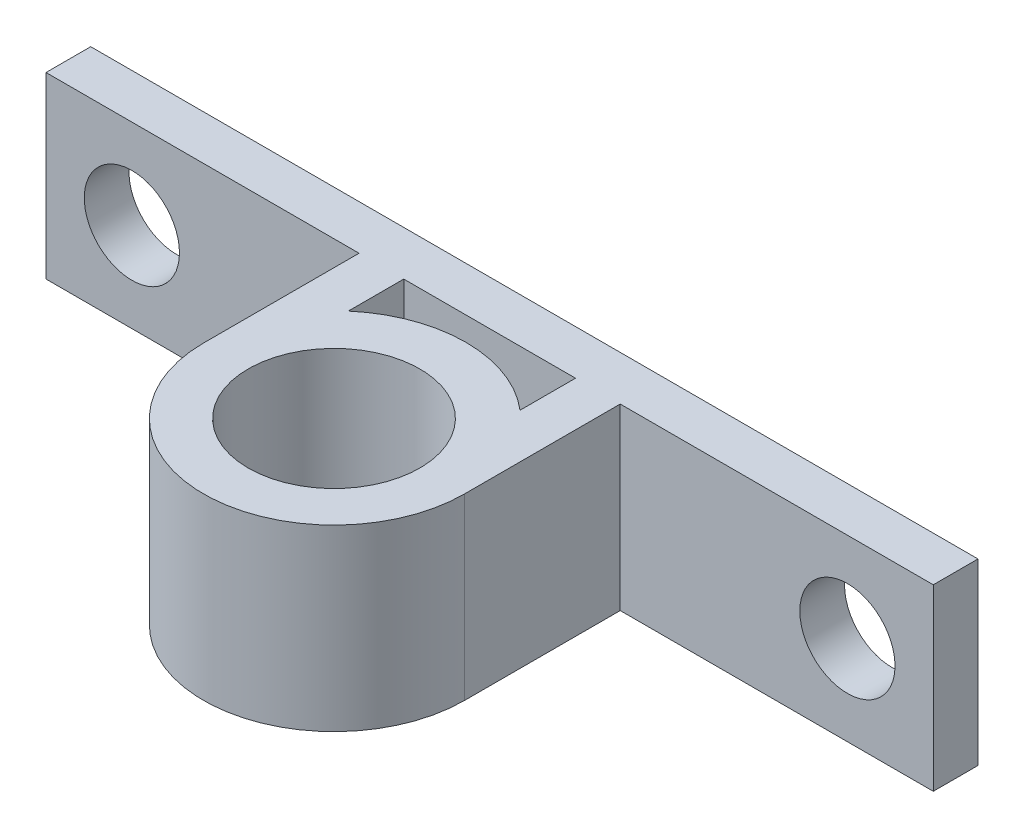
ISO-10303-21;
HEADER;
FILE_DESCRIPTION(('STEP AP214'),'2;1');
FILE_NAME('part.step','',(''),(''),'','','');
FILE_SCHEMA(('AUTOMOTIVE_DESIGN { 1 0 10303 214 1 1 1 1 }'));
ENDSEC;
DATA;
#1=APPLICATION_CONTEXT('core data for automotive mechanical design processes');
#2=APPLICATION_PROTOCOL_DEFINITION('international standard','automotive_design',2000,#1);
#3=PRODUCT_CONTEXT('',#1,'mechanical');
#4=PRODUCT('Part','Part','',(#3));
#5=PRODUCT_RELATED_PRODUCT_CATEGORY('part','',(#4));
#6=PRODUCT_DEFINITION_FORMATION('','',#4);
#7=PRODUCT_DEFINITION_CONTEXT('part definition',#1,'design');
#8=PRODUCT_DEFINITION('design','',#6,#7);
#9=PRODUCT_DEFINITION_SHAPE('','',#8);
#10=(LENGTH_UNIT() NAMED_UNIT(*) SI_UNIT(.MILLI.,.METRE.));
#11=(NAMED_UNIT(*) PLANE_ANGLE_UNIT() SI_UNIT($,.RADIAN.));
#12=(NAMED_UNIT(*) SI_UNIT($,.STERADIAN.) SOLID_ANGLE_UNIT());
#13=UNCERTAINTY_MEASURE_WITH_UNIT(LENGTH_MEASURE(1.E-05),#10,'distance_accuracy_value','');
#14=(GEOMETRIC_REPRESENTATION_CONTEXT(3) GLOBAL_UNCERTAINTY_ASSIGNED_CONTEXT((#13)) GLOBAL_UNIT_ASSIGNED_CONTEXT((#10,
#11,#12)) REPRESENTATION_CONTEXT('',''));
#15=CARTESIAN_POINT('',(0.,0.,0.));
#16=DIRECTION('',(0.,0.,1.));
#17=DIRECTION('',(1.,0.,0.));
#18=AXIS2_PLACEMENT_3D('',#15,#16,#17);
#19=CARTESIAN_POINT('',(0.,12.7,0.));
#20=DIRECTION('',(0.,-1.,0.));
#21=DIRECTION('',(0.,0.,-1.));
#22=AXIS2_PLACEMENT_3D('',#19,#20,#21);
#23=PLANE('',#22);
#24=CARTESIAN_POINT('',(0.,12.7,0.));
#25=DIRECTION('',(0.,1.,0.));
#26=DIRECTION('',(0.,0.,1.));
#27=AXIS2_PLACEMENT_3D('',#24,#25,#26);
#28=CIRCLE('',#27,6.096);
#29=CARTESIAN_POINT('',(0.,12.7,6.096));
#30=VERTEX_POINT('',#29);
#31=EDGE_CURVE('E159',#30,#30,#28,.T.);
#32=ORIENTED_EDGE('',*,*,#31,.F.);
#33=EDGE_LOOP('',(#32));
#34=FACE_BOUND('',#33,.T.);
#35=CARTESIAN_POINT('',(0.,12.7,0.));
#36=DIRECTION('',(0.,1.,0.));
#37=DIRECTION('',(0.,0.,-1.));
#38=AXIS2_PLACEMENT_3D('',#35,#36,#37);
#39=CIRCLE('',#38,9.271);
#40=CARTESIAN_POINT('',(-9.271,12.7,0.));
#41=VERTEX_POINT('',#40);
#42=CARTESIAN_POINT('',(9.271,12.7,0.));
#43=VERTEX_POINT('',#42);
#44=EDGE_CURVE('E165',#41,#43,#39,.T.);
#45=ORIENTED_EDGE('',*,*,#44,.T.);
#46=DIRECTION('',(0.,0.,-1.));
#47=VECTOR('',#46,1.);
#48=CARTESIAN_POINT('',(9.271,12.7,0.));
#49=LINE('',#48,#47);
#50=CARTESIAN_POINT('',(9.271,12.7,-11.049));
#51=VERTEX_POINT('',#50);
#52=EDGE_CURVE('E168',#43,#51,#49,.T.);
#53=ORIENTED_EDGE('',*,*,#52,.T.);
#54=DIRECTION('',(1.,0.,0.));
#55=VECTOR('',#54,1.);
#56=CARTESIAN_POINT('',(9.271,12.7,-11.049));
#57=LINE('',#56,#55);
#58=CARTESIAN_POINT('',(31.496,12.7,-11.049));
#59=VERTEX_POINT('',#58);
#60=EDGE_CURVE('E171',#51,#59,#57,.T.);
#61=ORIENTED_EDGE('',*,*,#60,.T.);
#62=DIRECTION('',(0.,0.,-1.));
#63=VECTOR('',#62,1.);
#64=CARTESIAN_POINT('',(31.496,12.7,-11.049));
#65=LINE('',#64,#63);
#66=CARTESIAN_POINT('',(31.496,12.7,-14.224));
#67=VERTEX_POINT('',#66);
#68=EDGE_CURVE('E173',#59,#67,#65,.T.);
#69=ORIENTED_EDGE('',*,*,#68,.T.);
#70=DIRECTION('',(-1.,0.,0.));
#71=VECTOR('',#70,1.);
#72=CARTESIAN_POINT('',(6.096,12.7,-14.224));
#73=LINE('',#72,#71);
#74=CARTESIAN_POINT('',(-31.496,12.7,-14.224));
#75=VERTEX_POINT('',#74);
#76=EDGE_CURVE('E175',#67,#75,#73,.T.);
#77=ORIENTED_EDGE('',*,*,#76,.T.);
#78=DIRECTION('',(0.,0.,1.));
#79=VECTOR('',#78,1.);
#80=CARTESIAN_POINT('',(-31.496,12.7,-11.049));
#81=LINE('',#80,#79);
#82=CARTESIAN_POINT('',(-31.496,12.7,-11.049));
#83=VERTEX_POINT('',#82);
#84=EDGE_CURVE('E177',#75,#83,#81,.T.);
#85=ORIENTED_EDGE('',*,*,#84,.T.);
#86=DIRECTION('',(1.,0.,0.));
#87=VECTOR('',#86,1.);
#88=CARTESIAN_POINT('',(-9.271,12.7,-11.049));
#89=LINE('',#88,#87);
#90=CARTESIAN_POINT('',(-9.271,12.7,-11.049));
#91=VERTEX_POINT('',#90);
#92=EDGE_CURVE('E179',#83,#91,#89,.T.);
#93=ORIENTED_EDGE('',*,*,#92,.T.);
#94=DIRECTION('',(0.,0.,1.));
#95=VECTOR('',#94,1.);
#96=CARTESIAN_POINT('',(-9.271,12.7,0.));
#97=LINE('',#96,#95);
#98=EDGE_CURVE('E181',#91,#41,#97,.T.);
#99=ORIENTED_EDGE('',*,*,#98,.T.);
#100=EDGE_LOOP('',(#45,#53,#61,#69,#77,#85,#93,#99));
#101=FACE_BOUND('',#100,.T.);
#102=CARTESIAN_POINT('',(0.,12.7,0.));
#103=DIRECTION('',(0.,-1.,0.));
#104=DIRECTION('',(0.,0.,-1.));
#105=AXIS2_PLACEMENT_3D('',#102,#103,#104);
#106=CIRCLE('',#105,9.36705716860957);
#107=CARTESIAN_POINT('',(-6.096,12.7,-7.112));
#108=VERTEX_POINT('',#107);
#109=CARTESIAN_POINT('',(6.096,12.7,-7.112));
#110=VERTEX_POINT('',#109);
#111=EDGE_CURVE('E121',#108,#110,#106,.T.);
#112=ORIENTED_EDGE('',*,*,#111,.F.);
#113=DIRECTION('',(0.,0.,1.));
#114=VECTOR('',#113,1.);
#115=CARTESIAN_POINT('',(-6.096,12.7,-7.112));
#116=LINE('',#115,#114);
#117=CARTESIAN_POINT('',(-6.096,12.7,-11.049));
#118=VERTEX_POINT('',#117);
#119=EDGE_CURVE('E143',#118,#108,#116,.T.);
#120=ORIENTED_EDGE('',*,*,#119,.F.);
#121=DIRECTION('',(-1.,0.,0.));
#122=VECTOR('',#121,1.);
#123=CARTESIAN_POINT('',(-6.096,12.7,-11.049));
#124=LINE('',#123,#122);
#125=CARTESIAN_POINT('',(6.096,12.7,-11.049));
#126=VERTEX_POINT('',#125);
#127=EDGE_CURVE('E141',#126,#118,#124,.T.);
#128=ORIENTED_EDGE('',*,*,#127,.F.);
#129=DIRECTION('',(0.,0.,-1.));
#130=VECTOR('',#129,1.);
#131=CARTESIAN_POINT('',(6.096,12.7,-7.112));
#132=LINE('',#131,#130);
#133=EDGE_CURVE('E129',#110,#126,#132,.T.);
#134=ORIENTED_EDGE('',*,*,#133,.F.);
#135=EDGE_LOOP('',(#112,#120,#128,#134));
#136=FACE_BOUND('',#135,.T.);
#137=ADVANCED_FACE('F32',(#34,#101,#136),#23,.F.);
#138=CARTESIAN_POINT('',(0.,0.,0.));
#139=DIRECTION('',(0.,-1.,0.));
#140=DIRECTION('',(0.,0.,-1.));
#141=AXIS2_PLACEMENT_3D('',#138,#139,#140);
#142=PLANE('',#141);
#143=CARTESIAN_POINT('',(0.,0.,0.));
#144=DIRECTION('',(0.,1.,0.));
#145=DIRECTION('',(0.,0.,-1.));
#146=AXIS2_PLACEMENT_3D('',#143,#144,#145);
#147=CIRCLE('',#146,9.271);
#148=CARTESIAN_POINT('',(-9.271,0.,0.));
#149=VERTEX_POINT('',#148);
#150=CARTESIAN_POINT('',(9.271,0.,0.));
#151=VERTEX_POINT('',#150);
#152=EDGE_CURVE('E162',#149,#151,#147,.T.);
#153=ORIENTED_EDGE('',*,*,#152,.F.);
#154=DIRECTION('',(0.,0.,1.));
#155=VECTOR('',#154,1.);
#156=CARTESIAN_POINT('',(-9.271,0.,0.));
#157=LINE('',#156,#155);
#158=CARTESIAN_POINT('',(-9.271,0.,-11.049));
#159=VERTEX_POINT('',#158);
#160=EDGE_CURVE('E169',#159,#149,#157,.T.);
#161=ORIENTED_EDGE('',*,*,#160,.F.);
#162=DIRECTION('',(1.,0.,0.));
#163=VECTOR('',#162,1.);
#164=CARTESIAN_POINT('',(-9.271,0.,-11.049));
#165=LINE('',#164,#163);
#166=CARTESIAN_POINT('',(-31.496,0.,-11.049));
#167=VERTEX_POINT('',#166);
#168=EDGE_CURVE('E197',#167,#159,#165,.T.);
#169=ORIENTED_EDGE('',*,*,#168,.F.);
#170=DIRECTION('',(0.,0.,1.));
#171=VECTOR('',#170,1.);
#172=CARTESIAN_POINT('',(-31.496,0.,-11.049));
#173=LINE('',#172,#171);
#174=CARTESIAN_POINT('',(-31.496,0.,-14.224));
#175=VERTEX_POINT('',#174);
#176=EDGE_CURVE('E195',#175,#167,#173,.T.);
#177=ORIENTED_EDGE('',*,*,#176,.F.);
#178=DIRECTION('',(-1.,0.,0.));
#179=VECTOR('',#178,1.);
#180=CARTESIAN_POINT('',(-6.096,0.,-14.224));
#181=LINE('',#180,#179);
#182=CARTESIAN_POINT('',(31.496,0.,-14.224));
#183=VERTEX_POINT('',#182);
#184=EDGE_CURVE('E193',#183,#175,#181,.T.);
#185=ORIENTED_EDGE('',*,*,#184,.F.);
#186=DIRECTION('',(0.,0.,-1.));
#187=VECTOR('',#186,1.);
#188=CARTESIAN_POINT('',(31.496,0.,-11.049));
#189=LINE('',#188,#187);
#190=CARTESIAN_POINT('',(31.496,0.,-11.049));
#191=VERTEX_POINT('',#190);
#192=EDGE_CURVE('E190',#191,#183,#189,.T.);
#193=ORIENTED_EDGE('',*,*,#192,.F.);
#194=DIRECTION('',(1.,0.,0.));
#195=VECTOR('',#194,1.);
#196=CARTESIAN_POINT('',(9.271,0.,-11.049));
#197=LINE('',#196,#195);
#198=CARTESIAN_POINT('',(9.271,0.,-11.049));
#199=VERTEX_POINT('',#198);
#200=EDGE_CURVE('E188',#199,#191,#197,.T.);
#201=ORIENTED_EDGE('',*,*,#200,.F.);
#202=DIRECTION('',(0.,0.,-1.));
#203=VECTOR('',#202,1.);
#204=CARTESIAN_POINT('',(9.271,0.,0.));
#205=LINE('',#204,#203);
#206=EDGE_CURVE('E186',#151,#199,#205,.T.);
#207=ORIENTED_EDGE('',*,*,#206,.F.);
#208=EDGE_LOOP('',(#153,#161,#169,#177,#185,#193,#201,#207));
#209=FACE_BOUND('',#208,.T.);
#210=CARTESIAN_POINT('',(0.,0.,0.));
#211=DIRECTION('',(0.,1.,0.));
#212=DIRECTION('',(0.,0.,1.));
#213=AXIS2_PLACEMENT_3D('',#210,#211,#212);
#214=CIRCLE('',#213,6.096);
#215=CARTESIAN_POINT('',(0.,0.,6.096));
#216=VERTEX_POINT('',#215);
#217=EDGE_CURVE('E137',#216,#216,#214,.T.);
#218=ORIENTED_EDGE('',*,*,#217,.T.);
#219=EDGE_LOOP('',(#218));
#220=FACE_BOUND('',#219,.T.);
#221=DIRECTION('',(0.,0.,1.));
#222=VECTOR('',#221,1.);
#223=CARTESIAN_POINT('',(-6.096,0.,-7.112));
#224=LINE('',#223,#222);
#225=CARTESIAN_POINT('',(-6.096,0.,-11.049));
#226=VERTEX_POINT('',#225);
#227=CARTESIAN_POINT('',(-6.096,0.,-7.112));
#228=VERTEX_POINT('',#227);
#229=EDGE_CURVE('E130',#226,#228,#224,.T.);
#230=ORIENTED_EDGE('',*,*,#229,.T.);
#231=CARTESIAN_POINT('',(0.,0.,0.));
#232=DIRECTION('',(0.,-1.,0.));
#233=DIRECTION('',(0.,0.,-1.));
#234=AXIS2_PLACEMENT_3D('',#231,#232,#233);
#235=CIRCLE('',#234,9.36705716860957);
#236=CARTESIAN_POINT('',(6.096,0.,-7.112));
#237=VERTEX_POINT('',#236);
#238=EDGE_CURVE('E55',#228,#237,#235,.T.);
#239=ORIENTED_EDGE('',*,*,#238,.T.);
#240=DIRECTION('',(0.,0.,-1.));
#241=VECTOR('',#240,1.);
#242=CARTESIAN_POINT('',(6.096,0.,-7.112));
#243=LINE('',#242,#241);
#244=CARTESIAN_POINT('',(6.096,0.,-11.049));
#245=VERTEX_POINT('',#244);
#246=EDGE_CURVE('E136',#237,#245,#243,.T.);
#247=ORIENTED_EDGE('',*,*,#246,.T.);
#248=DIRECTION('',(-1.,0.,0.));
#249=VECTOR('',#248,1.);
#250=CARTESIAN_POINT('',(-6.096,0.,-11.049));
#251=LINE('',#250,#249);
#252=EDGE_CURVE('E151',#245,#226,#251,.T.);
#253=ORIENTED_EDGE('',*,*,#252,.T.);
#254=EDGE_LOOP('',(#230,#239,#247,#253));
#255=FACE_BOUND('',#254,.T.);
#256=ADVANCED_FACE('F227',(#209,#220,#255),#142,.T.);
#257=CARTESIAN_POINT('',(0.,12.7,0.));
#258=DIRECTION('',(0.,-1.,0.));
#259=DIRECTION('',(0.,0.,-1.));
#260=AXIS2_PLACEMENT_3D('',#257,#258,#259);
#261=CYLINDRICAL_SURFACE('',#260,9.271);
#262=ORIENTED_EDGE('',*,*,#152,.T.);
#263=DIRECTION('',(0.,-1.,0.));
#264=VECTOR('',#263,1.);
#265=CARTESIAN_POINT('',(9.271,12.7,0.));
#266=LINE('',#265,#264);
#267=EDGE_CURVE('E11',#43,#151,#266,.T.);
#268=ORIENTED_EDGE('',*,*,#267,.F.);
#269=ORIENTED_EDGE('',*,*,#44,.F.);
#270=DIRECTION('',(0.,-1.,0.));
#271=VECTOR('',#270,1.);
#272=CARTESIAN_POINT('',(-9.271,12.7,0.));
#273=LINE('',#272,#271);
#274=EDGE_CURVE('E183',#41,#149,#273,.T.);
#275=ORIENTED_EDGE('',*,*,#274,.T.);
#276=EDGE_LOOP('',(#262,#268,#269,#275));
#277=FACE_BOUND('',#276,.T.);
#278=ADVANCED_FACE('F34',(#277),#261,.T.);
#279=CARTESIAN_POINT('',(9.271,12.7,0.));
#280=DIRECTION('',(-1.,0.,0.));
#281=DIRECTION('',(0.,0.,1.));
#282=AXIS2_PLACEMENT_3D('',#279,#280,#281);
#283=PLANE('',#282);
#284=ORIENTED_EDGE('',*,*,#206,.T.);
#285=DIRECTION('',(0.,-1.,0.));
#286=VECTOR('',#285,1.);
#287=CARTESIAN_POINT('',(9.271,12.7,-11.049));
#288=LINE('',#287,#286);
#289=EDGE_CURVE('E40',#51,#199,#288,.T.);
#290=ORIENTED_EDGE('',*,*,#289,.F.);
#291=ORIENTED_EDGE('',*,*,#52,.F.);
#292=ORIENTED_EDGE('',*,*,#267,.T.);
#293=EDGE_LOOP('',(#284,#290,#291,#292));
#294=FACE_BOUND('',#293,.T.);
#295=ADVANCED_FACE('F243',(#294),#283,.F.);
#296=CARTESIAN_POINT('',(9.271,12.7,-11.049));
#297=DIRECTION('',(0.,0.,-1.));
#298=DIRECTION('',(-1.,0.,0.));
#299=AXIS2_PLACEMENT_3D('',#296,#297,#298);
#300=PLANE('',#299);
#301=CARTESIAN_POINT('',(25.4,6.35,-11.049));
#302=DIRECTION('',(0.,0.,1.));
#303=DIRECTION('',(-1.,0.,0.));
#304=AXIS2_PLACEMENT_3D('',#301,#302,#303);
#305=CIRCLE('',#304,3.3782);
#306=CARTESIAN_POINT('',(22.0218,6.35,-11.049));
#307=VERTEX_POINT('',#306);
#308=EDGE_CURVE('E372',#307,#307,#305,.T.);
#309=ORIENTED_EDGE('',*,*,#308,.F.);
#310=EDGE_LOOP('',(#309));
#311=FACE_BOUND('',#310,.T.);
#312=ORIENTED_EDGE('',*,*,#200,.T.);
#313=DIRECTION('',(0.,-1.,0.));
#314=VECTOR('',#313,1.);
#315=CARTESIAN_POINT('',(31.496,12.7,-11.049));
#316=LINE('',#315,#314);
#317=EDGE_CURVE('E214',#59,#191,#316,.T.);
#318=ORIENTED_EDGE('',*,*,#317,.F.);
#319=ORIENTED_EDGE('',*,*,#60,.F.);
#320=ORIENTED_EDGE('',*,*,#289,.T.);
#321=EDGE_LOOP('',(#312,#318,#319,#320));
#322=FACE_BOUND('',#321,.T.);
#323=ADVANCED_FACE('F221',(#311,#322),#300,.F.);
#324=CARTESIAN_POINT('',(31.496,12.7,-11.049));
#325=DIRECTION('',(-1.,0.,0.));
#326=DIRECTION('',(0.,0.,1.));
#327=AXIS2_PLACEMENT_3D('',#324,#325,#326);
#328=PLANE('',#327);
#329=ORIENTED_EDGE('',*,*,#192,.T.);
#330=DIRECTION('',(0.,-1.,0.));
#331=VECTOR('',#330,1.);
#332=CARTESIAN_POINT('',(31.496,12.7,-14.224));
#333=LINE('',#332,#331);
#334=EDGE_CURVE('E211',#67,#183,#333,.T.);
#335=ORIENTED_EDGE('',*,*,#334,.F.);
#336=ORIENTED_EDGE('',*,*,#68,.F.);
#337=ORIENTED_EDGE('',*,*,#317,.T.);
#338=EDGE_LOOP('',(#329,#335,#336,#337));
#339=FACE_BOUND('',#338,.T.);
#340=ADVANCED_FACE('F232',(#339),#328,.F.);
#341=CARTESIAN_POINT('',(-6.096,12.7,-14.224));
#342=DIRECTION('',(0.,0.,1.));
#343=DIRECTION('',(1.,0.,0.));
#344=AXIS2_PLACEMENT_3D('',#341,#342,#343);
#345=PLANE('',#344);
#346=CARTESIAN_POINT('',(-25.4,6.35,-14.224));
#347=DIRECTION('',(0.,0.,1.));
#348=DIRECTION('',(1.,0.,0.));
#349=AXIS2_PLACEMENT_3D('',#346,#347,#348);
#350=CIRCLE('',#349,3.3782);
#351=CARTESIAN_POINT('',(-22.0218,6.35,-14.224));
#352=VERTEX_POINT('',#351);
#353=EDGE_CURVE('E149',#352,#352,#350,.T.);
#354=ORIENTED_EDGE('',*,*,#353,.T.);
#355=EDGE_LOOP('',(#354));
#356=FACE_BOUND('',#355,.T.);
#357=CARTESIAN_POINT('',(25.4,6.35,-14.224));
#358=DIRECTION('',(0.,0.,1.));
#359=DIRECTION('',(-1.,0.,0.));
#360=AXIS2_PLACEMENT_3D('',#357,#358,#359);
#361=CIRCLE('',#360,3.3782);
#362=CARTESIAN_POINT('',(22.0218,6.35,-14.224));
#363=VERTEX_POINT('',#362);
#364=EDGE_CURVE('E369',#363,#363,#361,.T.);
#365=ORIENTED_EDGE('',*,*,#364,.T.);
#366=EDGE_LOOP('',(#365));
#367=FACE_BOUND('',#366,.T.);
#368=ORIENTED_EDGE('',*,*,#184,.T.);
#369=DIRECTION('',(0.,-1.,0.));
#370=VECTOR('',#369,1.);
#371=CARTESIAN_POINT('',(-31.496,12.7,-14.224));
#372=LINE('',#371,#370);
#373=EDGE_CURVE('E208',#75,#175,#372,.T.);
#374=ORIENTED_EDGE('',*,*,#373,.F.);
#375=ORIENTED_EDGE('',*,*,#76,.F.);
#376=ORIENTED_EDGE('',*,*,#334,.T.);
#377=EDGE_LOOP('',(#368,#374,#375,#376));
#378=FACE_BOUND('',#377,.T.);
#379=ADVANCED_FACE('F236',(#356,#367,#378),#345,.F.);
#380=CARTESIAN_POINT('',(-31.496,12.7,-11.049));
#381=DIRECTION('',(1.,0.,0.));
#382=DIRECTION('',(0.,0.,-1.));
#383=AXIS2_PLACEMENT_3D('',#380,#381,#382);
#384=PLANE('',#383);
#385=ORIENTED_EDGE('',*,*,#176,.T.);
#386=DIRECTION('',(0.,-1.,0.));
#387=VECTOR('',#386,1.);
#388=CARTESIAN_POINT('',(-31.496,12.7,-11.049));
#389=LINE('',#388,#387);
#390=EDGE_CURVE('E205',#83,#167,#389,.T.);
#391=ORIENTED_EDGE('',*,*,#390,.F.);
#392=ORIENTED_EDGE('',*,*,#84,.F.);
#393=ORIENTED_EDGE('',*,*,#373,.T.);
#394=EDGE_LOOP('',(#385,#391,#392,#393));
#395=FACE_BOUND('',#394,.T.);
#396=ADVANCED_FACE('F256',(#395),#384,.F.);
#397=CARTESIAN_POINT('',(-9.271,12.7,-11.049));
#398=DIRECTION('',(0.,0.,-1.));
#399=DIRECTION('',(-1.,0.,0.));
#400=AXIS2_PLACEMENT_3D('',#397,#398,#399);
#401=PLANE('',#400);
#402=CARTESIAN_POINT('',(-25.4,6.35,-11.049));
#403=DIRECTION('',(0.,0.,1.));
#404=DIRECTION('',(1.,0.,0.));
#405=AXIS2_PLACEMENT_3D('',#402,#403,#404);
#406=CIRCLE('',#405,3.3782);
#407=CARTESIAN_POINT('',(-22.0218,6.35,-11.049));
#408=VERTEX_POINT('',#407);
#409=EDGE_CURVE('E373',#408,#408,#406,.T.);
#410=ORIENTED_EDGE('',*,*,#409,.F.);
#411=EDGE_LOOP('',(#410));
#412=FACE_BOUND('',#411,.T.);
#413=ORIENTED_EDGE('',*,*,#168,.T.);
#414=DIRECTION('',(0.,-1.,0.));
#415=VECTOR('',#414,1.);
#416=CARTESIAN_POINT('',(-9.271,12.7,-11.049));
#417=LINE('',#416,#415);
#418=EDGE_CURVE('E202',#91,#159,#417,.T.);
#419=ORIENTED_EDGE('',*,*,#418,.F.);
#420=ORIENTED_EDGE('',*,*,#92,.F.);
#421=ORIENTED_EDGE('',*,*,#390,.T.);
#422=EDGE_LOOP('',(#413,#419,#420,#421));
#423=FACE_BOUND('',#422,.T.);
#424=ADVANCED_FACE('F254',(#412,#423),#401,.F.);
#425=CARTESIAN_POINT('',(-9.271,12.7,0.));
#426=DIRECTION('',(1.,0.,0.));
#427=DIRECTION('',(0.,0.,-1.));
#428=AXIS2_PLACEMENT_3D('',#425,#426,#427);
#429=PLANE('',#428);
#430=ORIENTED_EDGE('',*,*,#160,.T.);
#431=ORIENTED_EDGE('',*,*,#274,.F.);
#432=ORIENTED_EDGE('',*,*,#98,.F.);
#433=ORIENTED_EDGE('',*,*,#418,.T.);
#434=EDGE_LOOP('',(#430,#431,#432,#433));
#435=FACE_BOUND('',#434,.T.);
#436=ADVANCED_FACE('F249',(#435),#429,.F.);
#437=CARTESIAN_POINT('',(0.,12.7,0.));
#438=DIRECTION('',(0.,-1.,0.));
#439=DIRECTION('',(0.,0.,-1.));
#440=AXIS2_PLACEMENT_3D('',#437,#438,#439);
#441=CYLINDRICAL_SURFACE('',#440,6.096);
#442=ORIENTED_EDGE('',*,*,#31,.T.);
#443=EDGE_LOOP('',(#442));
#444=FACE_BOUND('',#443,.T.);
#445=ORIENTED_EDGE('',*,*,#217,.F.);
#446=EDGE_LOOP('',(#445));
#447=FACE_BOUND('',#446,.T.);
#448=ADVANCED_FACE('F276',(#444,#447),#441,.F.);
#449=CARTESIAN_POINT('',(0.,12.7,0.));
#450=DIRECTION('',(0.,-1.,0.));
#451=DIRECTION('',(0.,0.,-1.));
#452=AXIS2_PLACEMENT_3D('',#449,#450,#451);
#453=CYLINDRICAL_SURFACE('',#452,9.36705716860957);
#454=ORIENTED_EDGE('',*,*,#238,.F.);
#455=DIRECTION('',(0.,-1.,0.));
#456=VECTOR('',#455,1.);
#457=CARTESIAN_POINT('',(-6.096,12.7,-7.112));
#458=LINE('',#457,#456);
#459=EDGE_CURVE('E125',#108,#228,#458,.T.);
#460=ORIENTED_EDGE('',*,*,#459,.F.);
#461=ORIENTED_EDGE('',*,*,#111,.T.);
#462=DIRECTION('',(0.,-1.,0.));
#463=VECTOR('',#462,1.);
#464=CARTESIAN_POINT('',(6.096,12.7,-7.112));
#465=LINE('',#464,#463);
#466=EDGE_CURVE('E124',#110,#237,#465,.T.);
#467=ORIENTED_EDGE('',*,*,#466,.T.);
#468=EDGE_LOOP('',(#454,#460,#461,#467));
#469=FACE_BOUND('',#468,.T.);
#470=ADVANCED_FACE('F123',(#469),#453,.T.);
#471=CARTESIAN_POINT('',(6.096,12.7,-7.112));
#472=DIRECTION('',(-1.,0.,0.));
#473=DIRECTION('',(0.,0.,1.));
#474=AXIS2_PLACEMENT_3D('',#471,#472,#473);
#475=PLANE('',#474);
#476=ORIENTED_EDGE('',*,*,#246,.F.);
#477=ORIENTED_EDGE('',*,*,#466,.F.);
#478=ORIENTED_EDGE('',*,*,#133,.T.);
#479=DIRECTION('',(0.,-1.,0.));
#480=VECTOR('',#479,1.);
#481=CARTESIAN_POINT('',(6.096,12.7,-11.049));
#482=LINE('',#481,#480);
#483=EDGE_CURVE('E138',#126,#245,#482,.T.);
#484=ORIENTED_EDGE('',*,*,#483,.T.);
#485=EDGE_LOOP('',(#476,#477,#478,#484));
#486=FACE_BOUND('',#485,.T.);
#487=ADVANCED_FACE('F133',(#486),#475,.T.);
#488=CARTESIAN_POINT('',(-6.096,12.7,-11.049));
#489=DIRECTION('',(0.,0.,1.));
#490=DIRECTION('',(1.,0.,0.));
#491=AXIS2_PLACEMENT_3D('',#488,#489,#490);
#492=PLANE('',#491);
#493=ORIENTED_EDGE('',*,*,#252,.F.);
#494=ORIENTED_EDGE('',*,*,#483,.F.);
#495=ORIENTED_EDGE('',*,*,#127,.T.);
#496=DIRECTION('',(0.,-1.,0.));
#497=VECTOR('',#496,1.);
#498=CARTESIAN_POINT('',(-6.096,12.7,-11.049));
#499=LINE('',#498,#497);
#500=EDGE_CURVE('E47',#118,#226,#499,.T.);
#501=ORIENTED_EDGE('',*,*,#500,.T.);
#502=EDGE_LOOP('',(#493,#494,#495,#501));
#503=FACE_BOUND('',#502,.T.);
#504=ADVANCED_FACE('F294',(#503),#492,.T.);
#505=CARTESIAN_POINT('',(-6.096,12.7,-7.112));
#506=DIRECTION('',(1.,0.,0.));
#507=DIRECTION('',(0.,0.,-1.));
#508=AXIS2_PLACEMENT_3D('',#505,#506,#507);
#509=PLANE('',#508);
#510=ORIENTED_EDGE('',*,*,#229,.F.);
#511=ORIENTED_EDGE('',*,*,#500,.F.);
#512=ORIENTED_EDGE('',*,*,#119,.T.);
#513=ORIENTED_EDGE('',*,*,#459,.T.);
#514=EDGE_LOOP('',(#510,#511,#512,#513));
#515=FACE_BOUND('',#514,.T.);
#516=ADVANCED_FACE('F291',(#515),#509,.T.);
#517=CARTESIAN_POINT('',(-25.4,6.35,-14.224));
#518=DIRECTION('',(0.,0.,1.));
#519=DIRECTION('',(1.,0.,0.));
#520=AXIS2_PLACEMENT_3D('',#517,#518,#519);
#521=CYLINDRICAL_SURFACE('',#520,3.3782);
#522=ORIENTED_EDGE('',*,*,#353,.F.);
#523=EDGE_LOOP('',(#522));
#524=FACE_BOUND('',#523,.T.);
#525=ORIENTED_EDGE('',*,*,#409,.T.);
#526=EDGE_LOOP('',(#525));
#527=FACE_BOUND('',#526,.T.);
#528=ADVANCED_FACE('F293',(#524,#527),#521,.F.);
#529=CARTESIAN_POINT('',(25.4,6.35,-14.224));
#530=DIRECTION('',(0.,0.,1.));
#531=DIRECTION('',(1.,0.,0.));
#532=AXIS2_PLACEMENT_3D('',#529,#530,#531);
#533=CYLINDRICAL_SURFACE('',#532,3.3782);
#534=ORIENTED_EDGE('',*,*,#364,.F.);
#535=EDGE_LOOP('',(#534));
#536=FACE_BOUND('',#535,.T.);
#537=ORIENTED_EDGE('',*,*,#308,.T.);
#538=EDGE_LOOP('',(#537));
#539=FACE_BOUND('',#538,.T.);
#540=ADVANCED_FACE('F300',(#536,#539),#533,.F.);
#541=CLOSED_SHELL('',(#137,#256,#278,#295,#323,#340,#379,#396,#424,#436,#448,#470,#487,#504,
#516,#528,#540));
#542=MANIFOLD_SOLID_BREP('B2',#541);
#543=ADVANCED_BREP_SHAPE_REPRESENTATION('',(#18,#542),#14);
#544=SHAPE_DEFINITION_REPRESENTATION(#9,#543);
ENDSEC;
END-ISO-10303-21;
